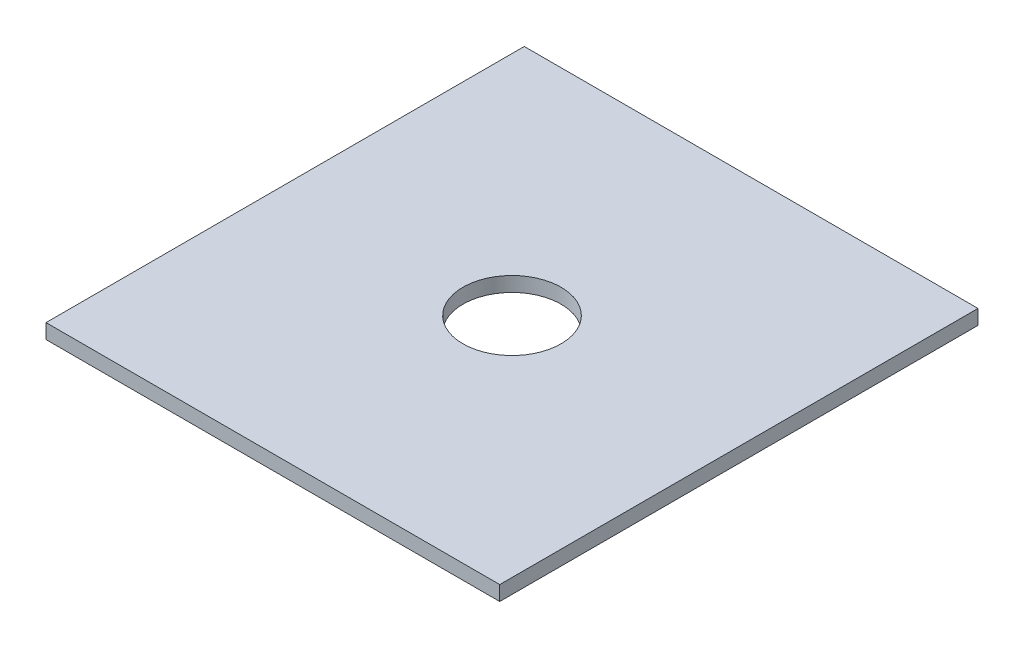
ISO-10303-21;
HEADER;
FILE_DESCRIPTION(('STEP AP214'),'2;1');
FILE_NAME('part.step','',(''),(''),'','','');
FILE_SCHEMA(('AUTOMOTIVE_DESIGN { 1 0 10303 214 1 1 1 1 }'));
ENDSEC;
DATA;
#1=APPLICATION_CONTEXT('core data for automotive mechanical design processes');
#2=APPLICATION_PROTOCOL_DEFINITION('international standard','automotive_design',2000,#1);
#3=PRODUCT_CONTEXT('',#1,'mechanical');
#4=PRODUCT('Part','Part','',(#3));
#5=PRODUCT_RELATED_PRODUCT_CATEGORY('part','',(#4));
#6=PRODUCT_DEFINITION_FORMATION('','',#4);
#7=PRODUCT_DEFINITION_CONTEXT('part definition',#1,'design');
#8=PRODUCT_DEFINITION('design','',#6,#7);
#9=PRODUCT_DEFINITION_SHAPE('','',#8);
#10=(LENGTH_UNIT() NAMED_UNIT(*) SI_UNIT(.MILLI.,.METRE.));
#11=(NAMED_UNIT(*) PLANE_ANGLE_UNIT() SI_UNIT($,.RADIAN.));
#12=(NAMED_UNIT(*) SI_UNIT($,.STERADIAN.) SOLID_ANGLE_UNIT());
#13=UNCERTAINTY_MEASURE_WITH_UNIT(LENGTH_MEASURE(1.E-05),#10,'distance_accuracy_value','');
#14=(GEOMETRIC_REPRESENTATION_CONTEXT(3) GLOBAL_UNCERTAINTY_ASSIGNED_CONTEXT((#13)) GLOBAL_UNIT_ASSIGNED_CONTEXT((#10,
#11,#12)) REPRESENTATION_CONTEXT('',''));
#15=CARTESIAN_POINT('',(0.,0.,0.));
#16=DIRECTION('',(0.,0.,1.));
#17=DIRECTION('',(1.,0.,0.));
#18=AXIS2_PLACEMENT_3D('',#15,#16,#17);
#19=CARTESIAN_POINT('',(0.,6.,0.));
#20=DIRECTION('',(0.,1.,0.));
#21=DIRECTION('',(0.,0.,1.));
#22=AXIS2_PLACEMENT_3D('',#19,#20,#21);
#23=PLANE('',#22);
#24=DIRECTION('',(0.,0.,1.));
#25=VECTOR('',#24,1.);
#26=CARTESIAN_POINT('',(-204.512195121951,6.,-107.012195121951));
#27=LINE('',#26,#25);
#28=CARTESIAN_POINT('',(-204.512195121951,6.,-107.012195121951));
#29=VERTEX_POINT('',#28);
#30=CARTESIAN_POINT('',(-204.512195121951,6.,87.9878048780488));
#31=VERTEX_POINT('',#30);
#32=EDGE_CURVE('E85',#29,#31,#27,.T.);
#33=ORIENTED_EDGE('',*,*,#32,.T.);
#34=DIRECTION('',(1.,0.,0.));
#35=VECTOR('',#34,1.);
#36=CARTESIAN_POINT('',(-204.512195121951,6.,87.9878048780488));
#37=LINE('',#36,#35);
#38=CARTESIAN_POINT('',(-19.5121951219513,6.,87.9878048780488));
#39=VERTEX_POINT('',#38);
#40=EDGE_CURVE('E80',#31,#39,#37,.T.);
#41=ORIENTED_EDGE('',*,*,#40,.T.);
#42=DIRECTION('',(0.,0.,-1.));
#43=VECTOR('',#42,1.);
#44=CARTESIAN_POINT('',(-19.5121951219513,6.,-107.012195121951));
#45=LINE('',#44,#43);
#46=CARTESIAN_POINT('',(-19.5121951219513,6.,-107.012195121951));
#47=VERTEX_POINT('',#46);
#48=EDGE_CURVE('E83',#39,#47,#45,.T.);
#49=ORIENTED_EDGE('',*,*,#48,.T.);
#50=DIRECTION('',(-1.,0.,0.));
#51=VECTOR('',#50,1.);
#52=CARTESIAN_POINT('',(-204.512195121951,6.,-107.012195121951));
#53=LINE('',#52,#51);
#54=EDGE_CURVE('E50',#47,#29,#53,.T.);
#55=ORIENTED_EDGE('',*,*,#54,.T.);
#56=EDGE_LOOP('',(#33,#41,#49,#55));
#57=FACE_BOUND('',#56,.T.);
#58=CARTESIAN_POINT('',(-112.012195121951,6.,-9.51219512195121));
#59=DIRECTION('',(0.,1.,0.));
#60=DIRECTION('',(0.,0.,1.));
#61=AXIS2_PLACEMENT_3D('',#58,#59,#60);
#62=CIRCLE('',#61,20.);
#63=CARTESIAN_POINT('',(-112.012195121951,6.,10.4878048780488));
#64=VERTEX_POINT('',#63);
#65=EDGE_CURVE('E100',#64,#64,#62,.T.);
#66=ORIENTED_EDGE('',*,*,#65,.F.);
#67=EDGE_LOOP('',(#66));
#68=FACE_BOUND('',#67,.T.);
#69=ADVANCED_FACE('F33',(#57,#68),#23,.T.);
#70=CARTESIAN_POINT('',(0.,0.,0.));
#71=DIRECTION('',(0.,1.,0.));
#72=DIRECTION('',(0.,0.,1.));
#73=AXIS2_PLACEMENT_3D('',#70,#71,#72);
#74=PLANE('',#73);
#75=DIRECTION('',(0.,0.,1.));
#76=VECTOR('',#75,1.);
#77=CARTESIAN_POINT('',(-204.512195121951,0.,-107.012195121951));
#78=LINE('',#77,#76);
#79=CARTESIAN_POINT('',(-204.512195121951,0.,-107.012195121951));
#80=VERTEX_POINT('',#79);
#81=CARTESIAN_POINT('',(-204.512195121951,0.,87.9878048780488));
#82=VERTEX_POINT('',#81);
#83=EDGE_CURVE('E97',#80,#82,#78,.T.);
#84=ORIENTED_EDGE('',*,*,#83,.F.);
#85=DIRECTION('',(-1.,0.,0.));
#86=VECTOR('',#85,1.);
#87=CARTESIAN_POINT('',(-204.512195121951,0.,-107.012195121951));
#88=LINE('',#87,#86);
#89=CARTESIAN_POINT('',(-19.5121951219513,0.,-107.012195121951));
#90=VERTEX_POINT('',#89);
#91=EDGE_CURVE('E73',#90,#80,#88,.T.);
#92=ORIENTED_EDGE('',*,*,#91,.F.);
#93=DIRECTION('',(0.,0.,-1.));
#94=VECTOR('',#93,1.);
#95=CARTESIAN_POINT('',(-19.5121951219513,0.,-107.012195121951));
#96=LINE('',#95,#94);
#97=CARTESIAN_POINT('',(-19.5121951219513,0.,87.9878048780488));
#98=VERTEX_POINT('',#97);
#99=EDGE_CURVE('E67',#98,#90,#96,.T.);
#100=ORIENTED_EDGE('',*,*,#99,.F.);
#101=DIRECTION('',(1.,0.,0.));
#102=VECTOR('',#101,1.);
#103=CARTESIAN_POINT('',(-204.512195121951,0.,87.9878048780488));
#104=LINE('',#103,#102);
#105=EDGE_CURVE('E89',#82,#98,#104,.T.);
#106=ORIENTED_EDGE('',*,*,#105,.F.);
#107=EDGE_LOOP('',(#84,#92,#100,#106));
#108=FACE_BOUND('',#107,.T.);
#109=CARTESIAN_POINT('',(-112.012195121951,0.,-9.51219512195121));
#110=DIRECTION('',(0.,1.,0.));
#111=DIRECTION('',(0.,0.,1.));
#112=AXIS2_PLACEMENT_3D('',#109,#110,#111);
#113=CIRCLE('',#112,20.);
#114=CARTESIAN_POINT('',(-112.012195121951,0.,10.4878048780488));
#115=VERTEX_POINT('',#114);
#116=EDGE_CURVE('E112',#115,#115,#113,.T.);
#117=ORIENTED_EDGE('',*,*,#116,.T.);
#118=EDGE_LOOP('',(#117));
#119=FACE_BOUND('',#118,.T.);
#120=ADVANCED_FACE('F108',(#108,#119),#74,.F.);
#121=CARTESIAN_POINT('',(-204.512195121951,6.,-107.012195121951));
#122=DIRECTION('',(1.,0.,0.));
#123=DIRECTION('',(0.,0.,-1.));
#124=AXIS2_PLACEMENT_3D('',#121,#122,#123);
#125=PLANE('',#124);
#126=ORIENTED_EDGE('',*,*,#83,.T.);
#127=DIRECTION('',(0.,-1.,0.));
#128=VECTOR('',#127,1.);
#129=CARTESIAN_POINT('',(-204.512195121951,6.,87.9878048780488));
#130=LINE('',#129,#128);
#131=EDGE_CURVE('E11',#31,#82,#130,.T.);
#132=ORIENTED_EDGE('',*,*,#131,.F.);
#133=ORIENTED_EDGE('',*,*,#32,.F.);
#134=DIRECTION('',(0.,-1.,0.));
#135=VECTOR('',#134,1.);
#136=CARTESIAN_POINT('',(-204.512195121951,6.,-107.012195121951));
#137=LINE('',#136,#135);
#138=EDGE_CURVE('E93',#29,#80,#137,.T.);
#139=ORIENTED_EDGE('',*,*,#138,.T.);
#140=EDGE_LOOP('',(#126,#132,#133,#139));
#141=FACE_BOUND('',#140,.T.);
#142=ADVANCED_FACE('F35',(#141),#125,.F.);
#143=CARTESIAN_POINT('',(-204.512195121951,6.,87.9878048780488));
#144=DIRECTION('',(0.,0.,-1.));
#145=DIRECTION('',(-1.,0.,0.));
#146=AXIS2_PLACEMENT_3D('',#143,#144,#145);
#147=PLANE('',#146);
#148=ORIENTED_EDGE('',*,*,#105,.T.);
#149=DIRECTION('',(0.,-1.,0.));
#150=VECTOR('',#149,1.);
#151=CARTESIAN_POINT('',(-19.5121951219513,6.,87.9878048780488));
#152=LINE('',#151,#150);
#153=EDGE_CURVE('E42',#39,#98,#152,.T.);
#154=ORIENTED_EDGE('',*,*,#153,.F.);
#155=ORIENTED_EDGE('',*,*,#40,.F.);
#156=ORIENTED_EDGE('',*,*,#131,.T.);
#157=EDGE_LOOP('',(#148,#154,#155,#156));
#158=FACE_BOUND('',#157,.T.);
#159=ADVANCED_FACE('F88',(#158),#147,.F.);
#160=CARTESIAN_POINT('',(-19.5121951219513,6.,-107.012195121951));
#161=DIRECTION('',(-1.,0.,0.));
#162=DIRECTION('',(0.,0.,1.));
#163=AXIS2_PLACEMENT_3D('',#160,#161,#162);
#164=PLANE('',#163);
#165=ORIENTED_EDGE('',*,*,#99,.T.);
#166=DIRECTION('',(0.,-1.,0.));
#167=VECTOR('',#166,1.);
#168=CARTESIAN_POINT('',(-19.5121951219513,6.,-107.012195121951));
#169=LINE('',#168,#167);
#170=EDGE_CURVE('E90',#47,#90,#169,.T.);
#171=ORIENTED_EDGE('',*,*,#170,.F.);
#172=ORIENTED_EDGE('',*,*,#48,.F.);
#173=ORIENTED_EDGE('',*,*,#153,.T.);
#174=EDGE_LOOP('',(#165,#171,#172,#173));
#175=FACE_BOUND('',#174,.T.);
#176=ADVANCED_FACE('F91',(#175),#164,.F.);
#177=CARTESIAN_POINT('',(-204.512195121951,6.,-107.012195121951));
#178=DIRECTION('',(0.,0.,1.));
#179=DIRECTION('',(1.,0.,0.));
#180=AXIS2_PLACEMENT_3D('',#177,#178,#179);
#181=PLANE('',#180);
#182=ORIENTED_EDGE('',*,*,#91,.T.);
#183=ORIENTED_EDGE('',*,*,#138,.F.);
#184=ORIENTED_EDGE('',*,*,#54,.F.);
#185=ORIENTED_EDGE('',*,*,#170,.T.);
#186=EDGE_LOOP('',(#182,#183,#184,#185));
#187=FACE_BOUND('',#186,.T.);
#188=ADVANCED_FACE('F105',(#187),#181,.F.);
#189=CARTESIAN_POINT('',(-112.012195121951,6.,-9.51219512195121));
#190=DIRECTION('',(0.,-1.,0.));
#191=DIRECTION('',(0.,0.,-1.));
#192=AXIS2_PLACEMENT_3D('',#189,#190,#191);
#193=CYLINDRICAL_SURFACE('',#192,20.);
#194=ORIENTED_EDGE('',*,*,#65,.T.);
#195=EDGE_LOOP('',(#194));
#196=FACE_BOUND('',#195,.T.);
#197=ORIENTED_EDGE('',*,*,#116,.F.);
#198=EDGE_LOOP('',(#197));
#199=FACE_BOUND('',#198,.T.);
#200=ADVANCED_FACE('F118',(#196,#199),#193,.F.);
#201=CLOSED_SHELL('',(#69,#120,#142,#159,#176,#188,#200));
#202=MANIFOLD_SOLID_BREP('B2',#201);
#203=ADVANCED_BREP_SHAPE_REPRESENTATION('',(#18,#202),#14);
#204=SHAPE_DEFINITION_REPRESENTATION(#9,#203);
ENDSEC;
END-ISO-10303-21;
